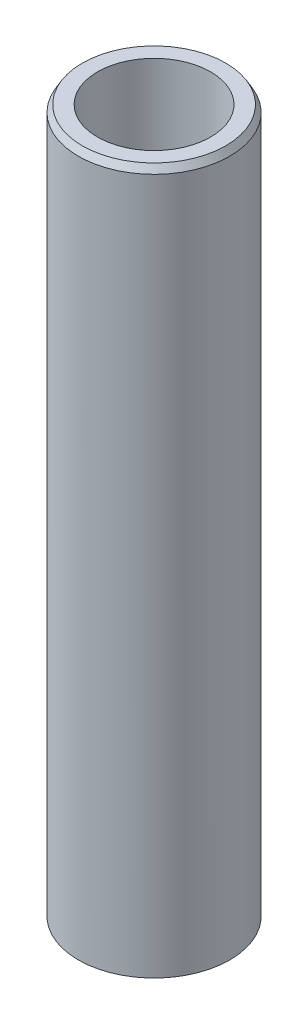
ISO-10303-21;
HEADER;
FILE_DESCRIPTION(('STEP AP214'),'2;1');
FILE_NAME('part.step','',(''),(''),'','','');
FILE_SCHEMA(('AUTOMOTIVE_DESIGN { 1 0 10303 214 1 1 1 1 }'));
ENDSEC;
DATA;
#1=APPLICATION_CONTEXT('core data for automotive mechanical design processes');
#2=APPLICATION_PROTOCOL_DEFINITION('international standard','automotive_design',2000,#1);
#3=PRODUCT_CONTEXT('',#1,'mechanical');
#4=PRODUCT('Part','Part','',(#3));
#5=PRODUCT_RELATED_PRODUCT_CATEGORY('part','',(#4));
#6=PRODUCT_DEFINITION_FORMATION('','',#4);
#7=PRODUCT_DEFINITION_CONTEXT('part definition',#1,'design');
#8=PRODUCT_DEFINITION('design','',#6,#7);
#9=PRODUCT_DEFINITION_SHAPE('','',#8);
#10=(LENGTH_UNIT() NAMED_UNIT(*) SI_UNIT(.MILLI.,.METRE.));
#11=(NAMED_UNIT(*) PLANE_ANGLE_UNIT() SI_UNIT($,.RADIAN.));
#12=(NAMED_UNIT(*) SI_UNIT($,.STERADIAN.) SOLID_ANGLE_UNIT());
#13=UNCERTAINTY_MEASURE_WITH_UNIT(LENGTH_MEASURE(1.E-05),#10,'distance_accuracy_value','');
#14=(GEOMETRIC_REPRESENTATION_CONTEXT(3) GLOBAL_UNCERTAINTY_ASSIGNED_CONTEXT((#13)) GLOBAL_UNIT_ASSIGNED_CONTEXT((#10,
#11,#12)) REPRESENTATION_CONTEXT('',''));
#15=CARTESIAN_POINT('',(0.,0.,0.));
#16=DIRECTION('',(0.,0.,1.));
#17=DIRECTION('',(1.,0.,0.));
#18=AXIS2_PLACEMENT_3D('',#15,#16,#17);
#19=CARTESIAN_POINT('',(0.,490.110721857144,0.));
#20=DIRECTION('',(0.,-1.,0.));
#21=DIRECTION('',(0.,0.,-1.));
#22=AXIS2_PLACEMENT_3D('',#19,#20,#21);
#23=CYLINDRICAL_SURFACE('',#22,52.5);
#24=CARTESIAN_POINT('',(0.,485.258304472495,0.));
#25=DIRECTION('',(0.,1.,0.));
#26=DIRECTION('',(0.,0.,1.));
#27=AXIS2_PLACEMENT_3D('',#24,#25,#26);
#28=CIRCLE('',#27,52.5);
#29=CARTESIAN_POINT('',(0.,485.258304472495,-52.5));
#30=VERTEX_POINT('',#29);
#31=EDGE_CURVE('E50',#30,#30,#28,.F.);
#32=CARTESIAN_POINT('',(0.,2.80154448324799,0.));
#33=DIRECTION('',(0.,1.,0.));
#34=DIRECTION('',(0.,0.,1.));
#35=AXIS2_PLACEMENT_3D('',#32,#33,#34);
#36=CIRCLE('',#35,52.5);
#37=CARTESIAN_POINT('',(0.,2.80154448324793,-52.5));
#38=VERTEX_POINT('',#37);
#39=EDGE_CURVE('E51',#38,#38,#36,.T.);
#40=CARTESIAN_POINT('',(0.,485.258304472495,-52.5));
#41=CARTESIAN_POINT('',(0.,480.232713222607,-52.5));
#42=CARTESIAN_POINT('',(0.,475.207121972719,-52.5));
#43=CARTESIAN_POINT('',(0.,465.155939472943,-52.5));
#44=CARTESIAN_POINT('',(0.,460.130348223055,-52.5));
#45=CARTESIAN_POINT('',(0.,450.079165723279,-52.5));
#46=CARTESIAN_POINT('',(0.,445.053574473391,-52.5));
#47=CARTESIAN_POINT('',(0.,435.002391973615,-52.5));
#48=CARTESIAN_POINT('',(0.,429.976800723727,-52.5));
#49=CARTESIAN_POINT('',(0.,419.925618223951,-52.5));
#50=CARTESIAN_POINT('',(0.,414.900026974063,-52.5));
#51=CARTESIAN_POINT('',(0.,404.848844474287,-52.5));
#52=CARTESIAN_POINT('',(0.,399.823253224399,-52.5));
#53=CARTESIAN_POINT('',(0.,389.772070724623,-52.5));
#54=CARTESIAN_POINT('',(0.,384.746479474735,-52.5));
#55=CARTESIAN_POINT('',(0.,374.695296974959,-52.5));
#56=CARTESIAN_POINT('',(0.,369.669705725071,-52.5));
#57=CARTESIAN_POINT('',(0.,359.618523225295,-52.5));
#58=CARTESIAN_POINT('',(0.,354.592931975407,-52.5));
#59=CARTESIAN_POINT('',(0.,344.541749475631,-52.5));
#60=CARTESIAN_POINT('',(0.,339.516158225743,-52.5));
#61=CARTESIAN_POINT('',(0.,329.464975725967,-52.5));
#62=CARTESIAN_POINT('',(0.,324.439384476079,-52.5));
#63=CARTESIAN_POINT('',(0.,314.388201976303,-52.5));
#64=CARTESIAN_POINT('',(0.,309.362610726415,-52.5));
#65=CARTESIAN_POINT('',(0.,299.311428226639,-52.5));
#66=CARTESIAN_POINT('',(0.,294.285836976751,-52.5));
#67=CARTESIAN_POINT('',(0.,284.234654476975,-52.5));
#68=CARTESIAN_POINT('',(0.,279.209063227087,-52.5));
#69=CARTESIAN_POINT('',(0.,269.157880727311,-52.5));
#70=CARTESIAN_POINT('',(0.,264.132289477424,-52.5));
#71=CARTESIAN_POINT('',(0.,254.081106977648,-52.5));
#72=CARTESIAN_POINT('',(0.,249.055515727759,-52.5));
#73=CARTESIAN_POINT('',(0.,239.004333227983,-52.5));
#74=CARTESIAN_POINT('',(0.,233.978741978096,-52.5));
#75=CARTESIAN_POINT('',(0.,223.92755947832,-52.5));
#76=CARTESIAN_POINT('',(0.,218.901968228432,-52.5));
#77=CARTESIAN_POINT('',(0.,208.850785728656,-52.5));
#78=CARTESIAN_POINT('',(0.,203.825194478768,-52.5));
#79=CARTESIAN_POINT('',(0.,193.774011978992,-52.5));
#80=CARTESIAN_POINT('',(0.,188.748420729104,-52.5));
#81=CARTESIAN_POINT('',(0.,178.697238229328,-52.5));
#82=CARTESIAN_POINT('',(0.,173.67164697944,-52.5));
#83=CARTESIAN_POINT('',(0.,163.620464479664,-52.5));
#84=CARTESIAN_POINT('',(0.,158.594873229776,-52.5));
#85=CARTESIAN_POINT('',(0.,148.54369073,-52.5));
#86=CARTESIAN_POINT('',(0.,143.518099480112,-52.5));
#87=CARTESIAN_POINT('',(0.,133.466916980336,-52.5));
#88=CARTESIAN_POINT('',(0.,128.441325730448,-52.5));
#89=CARTESIAN_POINT('',(0.,118.390143230672,-52.5));
#90=CARTESIAN_POINT('',(0.,113.364551980784,-52.5));
#91=CARTESIAN_POINT('',(0.,103.313369481008,-52.5));
#92=CARTESIAN_POINT('',(0.,98.2877782311198,-52.5));
#93=CARTESIAN_POINT('',(0.,88.2365957313438,-52.5));
#94=CARTESIAN_POINT('',(0.,83.2110044814558,-52.5));
#95=CARTESIAN_POINT('',(0.,73.1598219816798,-52.5));
#96=CARTESIAN_POINT('',(0.,68.1342307317918,-52.5));
#97=CARTESIAN_POINT('',(0.,58.0830482320158,-52.5));
#98=CARTESIAN_POINT('',(0.,53.0574569821278,-52.5));
#99=CARTESIAN_POINT('',(0.,43.0062744823519,-52.5));
#100=CARTESIAN_POINT('',(0.,37.9806832324639,-52.5));
#101=CARTESIAN_POINT('',(0.,27.9295007326879,-52.5));
#102=CARTESIAN_POINT('',(0.,22.9039094827999,-52.5));
#103=CARTESIAN_POINT('',(0.,12.8527269830239,-52.5));
#104=CARTESIAN_POINT('',(0.,7.82713573313593,-52.5));
#105=CARTESIAN_POINT('',(0.,2.80154448324793,-52.5));
#106=B_SPLINE_CURVE_WITH_KNOTS('',3,(#40,#41,#42,#43,#44,#45,#46,#47,#48,#49,#50,#51,#52,#53,
#54,#55,#56,#57,#58,#59,#60,#61,#62,#63,#64,#65,#66,#67,#68,#69,#70,#71,#72,#73,#74,#75,#76,#77,
#78,#79,#80,#81,#82,#83,#84,#85,#86,#87,#88,#89,#90,#91,#92,#93,#94,#95,#96,#97,#98,#99,#100,
#101,#102,#103,#104,#105),.UNSPECIFIED.,.F.,.F.,(4,2,2,2,2,2,2,2,2,2,2,2,2,2,2,2,2,2,2,2,2,2,2,
2,2,2,2,2,2,2,2,2,4),(0.,15.0767737496639,30.1535474993279,45.2303212489919,60.3070949986559,
75.3838687483198,90.4606424979838,105.537416247648,120.614189997312,135.690963746976,
150.76773749664,165.844511246304,180.921284995968,195.998058745632,211.074832495296,
226.15160624496,241.228379994624,256.305153744287,271.381927493951,286.458701243615,
301.535474993279,316.612248742943,331.689022492607,346.765796242271,361.842569991935,
376.919343741599,391.996117491263,407.072891240927,422.149664990591,437.226438740255,
452.303212489919,467.379986239583,482.456759989247),.UNSPECIFIED.);
#107=EDGE_CURVE('BSEAM39',#30,#38,#106,.T.);
#108=ORIENTED_EDGE('',*,*,#31,.T.);
#109=ORIENTED_EDGE('',*,*,#39,.T.);
#110=ORIENTED_EDGE('',*,*,#107,.T.);
#111=ORIENTED_EDGE('',*,*,#107,.F.);
#112=EDGE_LOOP('',(#108,#110,#109,#111));
#113=FACE_BOUND('',#112,.T.);
#114=ADVANCED_FACE('F39',(#113),#23,.T.);
#115=CARTESIAN_POINT('',(0.,490.110721857144,0.));
#116=DIRECTION('',(0.,1.,0.));
#117=DIRECTION('',(0.,0.,1.));
#118=AXIS2_PLACEMENT_3D('',#115,#116,#117);
#119=PLANE('',#118);
#120=CARTESIAN_POINT('',(0.,490.110721857144,0.));
#121=DIRECTION('',(0.,1.,0.));
#122=DIRECTION('',(0.,0.,1.));
#123=AXIS2_PLACEMENT_3D('',#120,#121,#122);
#124=CIRCLE('',#123,49.6984555167523);
#125=CARTESIAN_POINT('',(0.,490.110721857144,49.6984555167523));
#126=VERTEX_POINT('',#125);
#127=EDGE_CURVE('E54',#126,#126,#124,.T.);
#128=ORIENTED_EDGE('',*,*,#127,.T.);
#129=EDGE_LOOP('',(#128));
#130=FACE_BOUND('',#129,.T.);
#131=CARTESIAN_POINT('',(0.,490.110721857144,0.));
#132=DIRECTION('',(0.,1.,0.));
#133=DIRECTION('',(0.,0.,1.));
#134=AXIS2_PLACEMENT_3D('',#131,#132,#133);
#135=CIRCLE('',#134,39.1930981910907);
#136=CARTESIAN_POINT('',(0.,490.110721857144,-39.1930981910907));
#137=VERTEX_POINT('',#136);
#138=EDGE_CURVE('E58',#137,#137,#135,.T.);
#139=ORIENTED_EDGE('',*,*,#138,.F.);
#140=EDGE_LOOP('',(#139));
#141=FACE_BOUND('',#140,.T.);
#142=ADVANCED_FACE('F69',(#130,#141),#119,.T.);
#143=CARTESIAN_POINT('',(0.,0.,0.));
#144=DIRECTION('',(0.,1.,0.));
#145=DIRECTION('',(0.,0.,1.));
#146=AXIS2_PLACEMENT_3D('',#143,#144,#145);
#147=PLANE('',#146);
#148=CARTESIAN_POINT('',(0.,0.,0.));
#149=DIRECTION('',(0.,1.,0.));
#150=DIRECTION('',(0.,0.,1.));
#151=AXIS2_PLACEMENT_3D('',#148,#149,#150);
#152=CIRCLE('',#151,47.6475826153501);
#153=CARTESIAN_POINT('',(0.,0.,47.6475826153501));
#154=VERTEX_POINT('',#153);
#155=EDGE_CURVE('E10',#154,#154,#152,.F.);
#156=ORIENTED_EDGE('',*,*,#155,.T.);
#157=EDGE_LOOP('',(#156));
#158=FACE_BOUND('',#157,.T.);
#159=CARTESIAN_POINT('',(0.,0.,0.));
#160=DIRECTION('',(0.,1.,0.));
#161=DIRECTION('',(0.,0.,1.));
#162=AXIS2_PLACEMENT_3D('',#159,#160,#161);
#163=CIRCLE('',#162,39.1930981910907);
#164=CARTESIAN_POINT('',(0.,0.,-39.1930981910907));
#165=VERTEX_POINT('',#164);
#166=EDGE_CURVE('E63',#165,#165,#163,.T.);
#167=ORIENTED_EDGE('',*,*,#166,.T.);
#168=EDGE_LOOP('',(#167));
#169=FACE_BOUND('',#168,.T.);
#170=ADVANCED_FACE('F75',(#158,#169),#147,.F.);
#171=CARTESIAN_POINT('',(0.,490.110721857144,0.));
#172=DIRECTION('',(0.,-1.,0.));
#173=DIRECTION('',(0.,0.,-1.));
#174=AXIS2_PLACEMENT_3D('',#171,#172,#173);
#175=CYLINDRICAL_SURFACE('',#174,39.1930981910907);
#176=CARTESIAN_POINT('',(0.,490.110721857144,-39.1930981910907));
#177=CARTESIAN_POINT('',(0.,485.005401837799,-39.1930981910907));
#178=CARTESIAN_POINT('',(0.,479.900081818454,-39.1930981910907));
#179=CARTESIAN_POINT('',(0.,469.689441779763,-39.1930981910907));
#180=CARTESIAN_POINT('',(0.,464.584121760418,-39.1930981910907));
#181=CARTESIAN_POINT('',(0.,454.373481721728,-39.1930981910907));
#182=CARTESIAN_POINT('',(0.,449.268161702382,-39.1930981910907));
#183=CARTESIAN_POINT('',(0.,439.057521663692,-39.1930981910907));
#184=CARTESIAN_POINT('',(0.,433.952201644347,-39.1930981910907));
#185=CARTESIAN_POINT('',(0.,423.741561605656,-39.1930981910907));
#186=CARTESIAN_POINT('',(0.,418.636241586311,-39.1930981910907));
#187=CARTESIAN_POINT('',(0.,408.42560154762,-39.1930981910907));
#188=CARTESIAN_POINT('',(0.,403.320281528275,-39.1930981910907));
#189=CARTESIAN_POINT('',(0.,393.109641489585,-39.1930981910907));
#190=CARTESIAN_POINT('',(0.,388.004321470239,-39.1930981910907));
#191=CARTESIAN_POINT('',(0.,377.793681431549,-39.1930981910907));
#192=CARTESIAN_POINT('',(0.,372.688361412204,-39.1930981910907));
#193=CARTESIAN_POINT('',(0.,362.477721373513,-39.1930981910907));
#194=CARTESIAN_POINT('',(0.,357.372401354168,-39.1930981910907));
#195=CARTESIAN_POINT('',(0.,347.161761315477,-39.1930981910907));
#196=CARTESIAN_POINT('',(0.,342.056441296132,-39.1930981910907));
#197=CARTESIAN_POINT('',(0.,331.845801257442,-39.1930981910907));
#198=CARTESIAN_POINT('',(0.,326.740481238096,-39.1930981910907));
#199=CARTESIAN_POINT('',(0.,316.529841199406,-39.1930981910907));
#200=CARTESIAN_POINT('',(0.,311.42452118006,-39.1930981910907));
#201=CARTESIAN_POINT('',(0.,301.21388114137,-39.1930981910907));
#202=CARTESIAN_POINT('',(0.,296.108561122025,-39.1930981910907));
#203=CARTESIAN_POINT('',(0.,285.897921083334,-39.1930981910907));
#204=CARTESIAN_POINT('',(0.,280.792601063989,-39.1930981910907));
#205=CARTESIAN_POINT('',(0.,270.581961025298,-39.1930981910907));
#206=CARTESIAN_POINT('',(0.,265.476641005953,-39.1930981910907));
#207=CARTESIAN_POINT('',(0.,255.266000967263,-39.1930981910907));
#208=CARTESIAN_POINT('',(0.,250.160680947917,-39.1930981910907));
#209=CARTESIAN_POINT('',(0.,239.950040909227,-39.1930981910907));
#210=CARTESIAN_POINT('',(0.,234.844720889882,-39.1930981910907));
#211=CARTESIAN_POINT('',(0.,224.634080851191,-39.1930981910907));
#212=CARTESIAN_POINT('',(0.,219.528760831846,-39.1930981910907));
#213=CARTESIAN_POINT('',(0.,209.318120793155,-39.1930981910907));
#214=CARTESIAN_POINT('',(0.,204.21280077381,-39.1930981910907));
#215=CARTESIAN_POINT('',(0.,194.00216073512,-39.1930981910907));
#216=CARTESIAN_POINT('',(0.,188.896840715774,-39.1930981910907));
#217=CARTESIAN_POINT('',(0.,178.686200677084,-39.1930981910907));
#218=CARTESIAN_POINT('',(0.,173.580880657739,-39.1930981910907));
#219=CARTESIAN_POINT('',(0.,163.370240619048,-39.1930981910907));
#220=CARTESIAN_POINT('',(0.,158.264920599703,-39.1930981910907));
#221=CARTESIAN_POINT('',(0.,148.054280561012,-39.1930981910907));
#222=CARTESIAN_POINT('',(0.,142.948960541667,-39.1930981910907));
#223=CARTESIAN_POINT('',(0.,132.738320502977,-39.1930981910907));
#224=CARTESIAN_POINT('',(0.,127.633000483631,-39.1930981910907));
#225=CARTESIAN_POINT('',(0.,117.422360444941,-39.1930981910907));
#226=CARTESIAN_POINT('',(0.,112.317040425596,-39.1930981910907));
#227=CARTESIAN_POINT('',(0.,102.106400386905,-39.1930981910907));
#228=CARTESIAN_POINT('',(0.,97.0010803675598,-39.1930981910907));
#229=CARTESIAN_POINT('',(0.,86.7904403288693,-39.1930981910907));
#230=CARTESIAN_POINT('',(0.,81.6851203095241,-39.1930981910907));
#231=CARTESIAN_POINT('',(0.,71.4744802708335,-39.1930981910907));
#232=CARTESIAN_POINT('',(0.,66.3691602514883,-39.1930981910907));
#233=CARTESIAN_POINT('',(0.,56.1585202127977,-39.1930981910907));
#234=CARTESIAN_POINT('',(0.,51.0532001934525,-39.1930981910907));
#235=CARTESIAN_POINT('',(0.,40.842560154762,-39.1930981910907));
#236=CARTESIAN_POINT('',(0.,35.7372401354167,-39.1930981910907));
#237=CARTESIAN_POINT('',(0.,25.5266000967262,-39.1930981910907));
#238=CARTESIAN_POINT('',(0.,20.421280077381,-39.1930981910907));
#239=CARTESIAN_POINT('',(0.,10.2106400386904,-39.1930981910907));
#240=CARTESIAN_POINT('',(0.,5.10532001934519,-39.1930981910907));
#241=CARTESIAN_POINT('',(0.,0.,-39.1930981910907));
#242=B_SPLINE_CURVE_WITH_KNOTS('',3,(#176,#177,#178,#179,#180,#181,#182,#183,#184,#185,#186,
#187,#188,#189,#190,#191,#192,#193,#194,#195,#196,#197,#198,#199,#200,#201,#202,#203,#204,#205,
#206,#207,#208,#209,#210,#211,#212,#213,#214,#215,#216,#217,#218,#219,#220,#221,#222,#223,#224,
#225,#226,#227,#228,#229,#230,#231,#232,#233,#234,#235,#236,#237,#238,#239,#240,#241),
.UNSPECIFIED.,.F.,.F.,(4,2,2,2,2,2,2,2,2,2,2,2,2,2,2,2,2,2,2,2,2,2,2,2,2,2,2,2,2,2,2,2,4),(0.,
15.3159600580358,30.6319201160716,45.9478801741073,61.2638402321431,76.5798002901789,
91.8957603482146,107.21172040625,122.527680464286,137.843640522322,153.159600580358,
168.475560638393,183.791520696429,199.107480754465,214.423440812501,229.739400870537,
245.055360928572,260.371320986608,275.687281044644,291.00324110268,306.319201160715,
321.635161218751,336.951121276787,352.267081334823,367.583041392858,382.899001450894,
398.21496150893,413.530921566966,428.846881625001,444.162841683037,459.478801741073,
474.794761799109,490.110721857144),.UNSPECIFIED.);
#243=EDGE_CURVE('BSEAM70',#137,#165,#242,.T.);
#244=ORIENTED_EDGE('',*,*,#138,.T.);
#245=ORIENTED_EDGE('',*,*,#166,.F.);
#246=ORIENTED_EDGE('',*,*,#243,.T.);
#247=ORIENTED_EDGE('',*,*,#243,.F.);
#248=EDGE_LOOP('',(#244,#246,#245,#247));
#249=FACE_BOUND('',#248,.T.);
#250=ADVANCED_FACE('F70',(#249),#175,.F.);
#251=CARTESIAN_POINT('',(0.,490.110721857144,0.));
#252=DIRECTION('',(0.,-1.,0.));
#253=DIRECTION('',(0.,0.,-1.));
#254=AXIS2_PLACEMENT_3D('',#251,#252,#253);
#255=CONICAL_SURFACE('',#254,49.6984555167523,0.523598775598296);
#256=ORIENTED_EDGE('',*,*,#31,.F.);
#257=EDGE_LOOP('',(#256));
#258=FACE_BOUND('',#257,.T.);
#259=ORIENTED_EDGE('',*,*,#127,.F.);
#260=EDGE_LOOP('',(#259));
#261=FACE_BOUND('',#260,.T.);
#262=ADVANCED_FACE('F81',(#258,#261),#255,.T.);
#263=CARTESIAN_POINT('',(0.,2.80154448324799,0.));
#264=DIRECTION('',(0.,1.,0.));
#265=DIRECTION('',(0.,0.,1.));
#266=AXIS2_PLACEMENT_3D('',#263,#264,#265);
#267=CONICAL_SURFACE('',#266,52.5,1.0471975511966);
#268=ORIENTED_EDGE('',*,*,#155,.F.);
#269=EDGE_LOOP('',(#268));
#270=FACE_BOUND('',#269,.T.);
#271=ORIENTED_EDGE('',*,*,#39,.F.);
#272=EDGE_LOOP('',(#271));
#273=FACE_BOUND('',#272,.T.);
#274=ADVANCED_FACE('F45',(#270,#273),#267,.T.);
#275=CLOSED_SHELL('',(#114,#142,#170,#250,#262,#274));
#276=MANIFOLD_SOLID_BREP('B2',#275);
#277=ADVANCED_BREP_SHAPE_REPRESENTATION('',(#18,#276),#14);
#278=SHAPE_DEFINITION_REPRESENTATION(#9,#277);
ENDSEC;
END-ISO-10303-21;
